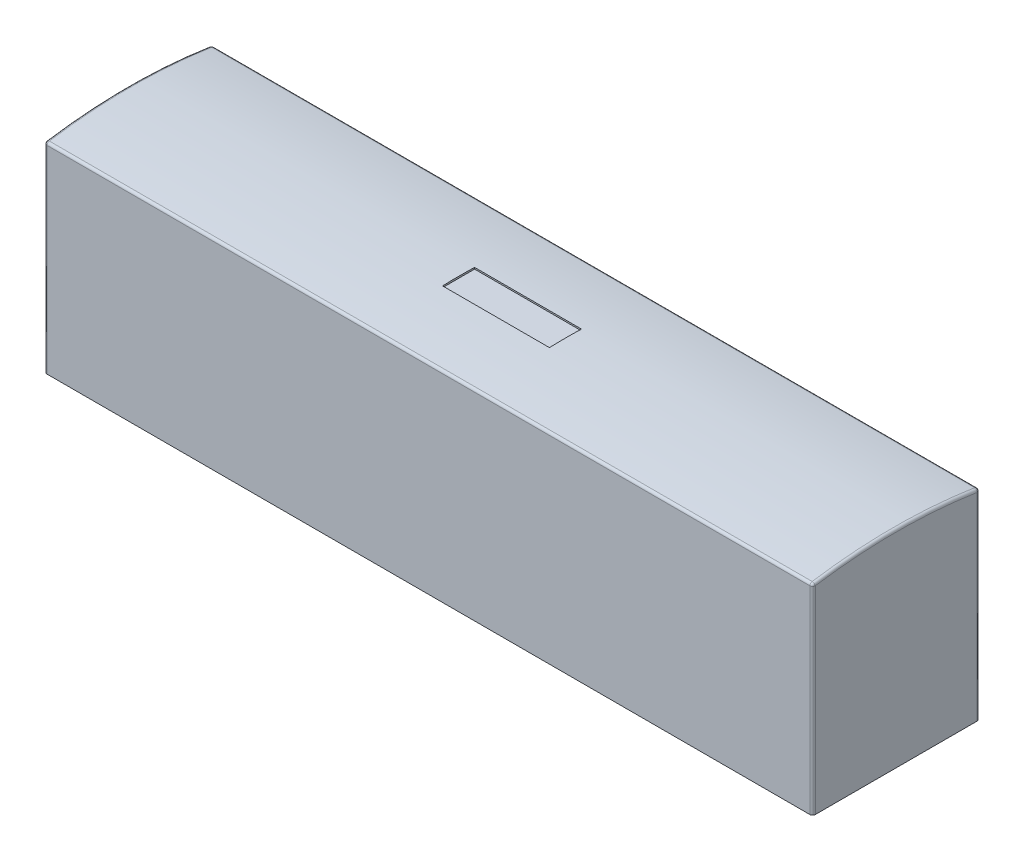
ISO-10303-21;
HEADER;
FILE_DESCRIPTION(('STEP AP214'),'2;1');
FILE_NAME('part.step','',(''),(''),'','','');
FILE_SCHEMA(('AUTOMOTIVE_DESIGN { 1 0 10303 214 1 1 1 1 }'));
ENDSEC;
DATA;
#1=APPLICATION_CONTEXT('core data for automotive mechanical design processes');
#2=APPLICATION_PROTOCOL_DEFINITION('international standard','automotive_design',2000,#1);
#3=PRODUCT_CONTEXT('',#1,'mechanical');
#4=PRODUCT('Part','Part','',(#3));
#5=PRODUCT_RELATED_PRODUCT_CATEGORY('part','',(#4));
#6=PRODUCT_DEFINITION_FORMATION('','',#4);
#7=PRODUCT_DEFINITION_CONTEXT('part definition',#1,'design');
#8=PRODUCT_DEFINITION('design','',#6,#7);
#9=PRODUCT_DEFINITION_SHAPE('','',#8);
#10=(LENGTH_UNIT() NAMED_UNIT(*) SI_UNIT(.MILLI.,.METRE.));
#11=(NAMED_UNIT(*) PLANE_ANGLE_UNIT() SI_UNIT($,.RADIAN.));
#12=(NAMED_UNIT(*) SI_UNIT($,.STERADIAN.) SOLID_ANGLE_UNIT());
#13=UNCERTAINTY_MEASURE_WITH_UNIT(LENGTH_MEASURE(1.E-05),#10,'distance_accuracy_value','');
#14=(GEOMETRIC_REPRESENTATION_CONTEXT(3) GLOBAL_UNCERTAINTY_ASSIGNED_CONTEXT((#13)) GLOBAL_UNIT_ASSIGNED_CONTEXT((#10,
#11,#12)) REPRESENTATION_CONTEXT('',''));
#15=CARTESIAN_POINT('',(0.,0.,0.));
#16=DIRECTION('',(0.,0.,1.));
#17=DIRECTION('',(1.,0.,0.));
#18=AXIS2_PLACEMENT_3D('',#15,#16,#17);
#19=CARTESIAN_POINT('',(-3.97181426867137,-7.78151274949029,-1.984375));
#20=DIRECTION('',(1.,0.,0.));
#21=DIRECTION('',(0.,0.,-1.));
#22=AXIS2_PLACEMENT_3D('',#19,#20,#21);
#23=CYLINDRICAL_SURFACE('',#22,12.7);
#24=CARTESIAN_POINT('',(18.19275,-7.78151274949029,-1.984375));
#25=DIRECTION('',(-1.,0.,0.));
#26=DIRECTION('',(0.,0.,1.));
#27=AXIS2_PLACEMENT_3D('',#24,#25,#26);
#28=CIRCLE('',#27,12.7);
#29=CARTESIAN_POINT('',(18.19275,4.77089988865146,-0.0538473618090457));
#30=VERTEX_POINT('',#29);
#31=CARTESIAN_POINT('',(18.19275,4.77089988865146,-3.91490263819095));
#32=VERTEX_POINT('',#31);
#33=EDGE_CURVE('E230',#30,#32,#28,.T.);
#34=ORIENTED_EDGE('',*,*,#33,.T.);
#35=DIRECTION('',(1.,0.,0.));
#36=VECTOR('',#35,1.);
#37=CARTESIAN_POINT('',(-3.97181426867137,4.77089988865146,-3.91490263819095));
#38=LINE('',#37,#36);
#39=CARTESIAN_POINT('',(0.0635000000000002,4.77089988865146,-3.91490263819095));
#40=VERTEX_POINT('',#39);
#41=EDGE_CURVE('E237',#32,#40,#38,.F.);
#42=ORIENTED_EDGE('',*,*,#41,.T.);
#43=CARTESIAN_POINT('',(0.0635000000000002,-7.78151274949029,-1.984375));
#44=DIRECTION('',(1.,0.,0.));
#45=DIRECTION('',(0.,0.,-1.));
#46=AXIS2_PLACEMENT_3D('',#43,#44,#45);
#47=CIRCLE('',#46,12.7);
#48=CARTESIAN_POINT('',(0.0635000000000002,4.77089988865146,-0.0538473618090455));
#49=VERTEX_POINT('',#48);
#50=EDGE_CURVE('E233',#40,#49,#47,.T.);
#51=ORIENTED_EDGE('',*,*,#50,.T.);
#52=DIRECTION('',(1.,0.,0.));
#53=VECTOR('',#52,1.);
#54=CARTESIAN_POINT('',(-3.97181426867137,4.77089988865146,-0.0538473618090453));
#55=LINE('',#54,#53);
#56=EDGE_CURVE('E227',#49,#30,#55,.T.);
#57=ORIENTED_EDGE('',*,*,#56,.T.);
#58=EDGE_LOOP('',(#34,#42,#51,#57));
#59=FACE_BOUND('',#58,.T.);
#60=DIRECTION('',(1.,0.,0.));
#61=VECTOR('',#60,1.);
#62=CARTESIAN_POINT('',(-3.97181426867137,4.91277096405574,-1.603375));
#63=LINE('',#62,#61);
#64=CARTESIAN_POINT('',(10.398125,4.91277096405574,-1.603375));
#65=VERTEX_POINT('',#64);
#66=CARTESIAN_POINT('',(7.858125,4.91277096405574,-1.603375));
#67=VERTEX_POINT('',#66);
#68=EDGE_CURVE('E213',#65,#67,#63,.F.);
#69=ORIENTED_EDGE('',*,*,#68,.T.);
#70=CARTESIAN_POINT('',(7.858125,-7.78151274949029,-1.984375));
#71=DIRECTION('',(1.,0.,0.));
#72=DIRECTION('',(0.,0.,-1.));
#73=AXIS2_PLACEMENT_3D('',#70,#71,#72);
#74=CIRCLE('',#73,12.7);
#75=CARTESIAN_POINT('',(7.858125,4.91277096405573,-2.365375));
#76=VERTEX_POINT('',#75);
#77=EDGE_CURVE('E204',#67,#76,#74,.F.);
#78=ORIENTED_EDGE('',*,*,#77,.T.);
#79=DIRECTION('',(1.,0.,0.));
#80=VECTOR('',#79,1.);
#81=CARTESIAN_POINT('',(-3.97181426867137,4.91277096405573,-2.365375));
#82=LINE('',#81,#80);
#83=CARTESIAN_POINT('',(10.398125,4.91277096405573,-2.365375));
#84=VERTEX_POINT('',#83);
#85=EDGE_CURVE('E208',#76,#84,#82,.T.);
#86=ORIENTED_EDGE('',*,*,#85,.T.);
#87=CARTESIAN_POINT('',(10.398125,-7.78151274949029,-1.984375));
#88=DIRECTION('',(-1.,0.,0.));
#89=DIRECTION('',(0.,0.,1.));
#90=AXIS2_PLACEMENT_3D('',#87,#88,#89);
#91=CIRCLE('',#90,12.7);
#92=EDGE_CURVE('E151',#84,#65,#91,.F.);
#93=ORIENTED_EDGE('',*,*,#92,.T.);
#94=EDGE_LOOP('',(#69,#78,#86,#93));
#95=FACE_BOUND('',#94,.T.);
#96=ADVANCED_FACE('F41',(#59,#95),#23,.T.);
#97=CARTESIAN_POINT('',(0.,4.7625,0.));
#98=DIRECTION('',(1.,0.,0.));
#99=DIRECTION('',(0.,0.,-1.));
#100=AXIS2_PLACEMENT_3D('',#97,#98,#99);
#101=PLANE('',#100);
#102=DIRECTION('',(0.,0.,1.));
#103=VECTOR('',#102,1.);
#104=CARTESIAN_POINT('',(0.,0.,0.));
#105=LINE('',#104,#103);
#106=CARTESIAN_POINT('',(0.,0.,-3.90525));
#107=VERTEX_POINT('',#106);
#108=CARTESIAN_POINT('',(0.,0.,-0.0635));
#109=VERTEX_POINT('',#108);
#110=EDGE_CURVE('E155',#107,#109,#105,.T.);
#111=ORIENTED_EDGE('',*,*,#110,.T.);
#112=DIRECTION('',(0.,-1.,0.));
#113=VECTOR('',#112,1.);
#114=CARTESIAN_POINT('',(0.,4.7625,-0.0635));
#115=LINE('',#114,#113);
#116=CARTESIAN_POINT('',(0.,4.70813782546075,-0.0635));
#117=VERTEX_POINT('',#116);
#118=EDGE_CURVE('E224',#109,#117,#115,.F.);
#119=ORIENTED_EDGE('',*,*,#118,.T.);
#120=CARTESIAN_POINT('',(0.,-7.78151274949029,-1.984375));
#121=DIRECTION('',(1.,0.,0.));
#122=DIRECTION('',(0.,0.,-1.));
#123=AXIS2_PLACEMENT_3D('',#120,#121,#122);
#124=CIRCLE('',#123,12.6365);
#125=CARTESIAN_POINT('',(0.,4.70813782546075,-3.90525));
#126=VERTEX_POINT('',#125);
#127=EDGE_CURVE('E220',#117,#126,#124,.F.);
#128=ORIENTED_EDGE('',*,*,#127,.T.);
#129=DIRECTION('',(0.,-1.,0.));
#130=VECTOR('',#129,1.);
#131=CARTESIAN_POINT('',(0.,4.7625,-3.90525));
#132=LINE('',#131,#130);
#133=EDGE_CURVE('E217',#126,#107,#132,.T.);
#134=ORIENTED_EDGE('',*,*,#133,.T.);
#135=EDGE_LOOP('',(#111,#119,#128,#134));
#136=FACE_BOUND('',#135,.T.);
#137=ADVANCED_FACE('F375',(#136),#101,.F.);
#138=CARTESIAN_POINT('',(0.,4.7625,0.));
#139=DIRECTION('',(0.,0.,-1.));
#140=DIRECTION('',(-1.,0.,0.));
#141=AXIS2_PLACEMENT_3D('',#138,#139,#140);
#142=PLANE('',#141);
#143=DIRECTION('',(-1.,0.,0.));
#144=VECTOR('',#143,1.);
#145=CARTESIAN_POINT('',(0.,4.70813782546075,0.));
#146=LINE('',#145,#144);
#147=CARTESIAN_POINT('',(18.19275,4.70813782546075,0.));
#148=VERTEX_POINT('',#147);
#149=CARTESIAN_POINT('',(0.0635,4.70813782546075,0.));
#150=VERTEX_POINT('',#149);
#151=EDGE_CURVE('E59',#148,#150,#146,.T.);
#152=ORIENTED_EDGE('',*,*,#151,.T.);
#153=DIRECTION('',(0.,-1.,0.));
#154=VECTOR('',#153,1.);
#155=CARTESIAN_POINT('',(0.0635,4.7625,0.));
#156=LINE('',#155,#154);
#157=CARTESIAN_POINT('',(0.0635,0.,0.));
#158=VERTEX_POINT('',#157);
#159=EDGE_CURVE('E262',#150,#158,#156,.T.);
#160=ORIENTED_EDGE('',*,*,#159,.T.);
#161=DIRECTION('',(1.,0.,0.));
#162=VECTOR('',#161,1.);
#163=CARTESIAN_POINT('',(0.,0.,0.));
#164=LINE('',#163,#162);
#165=CARTESIAN_POINT('',(18.19275,0.,0.));
#166=VERTEX_POINT('',#165);
#167=EDGE_CURVE('E193',#158,#166,#164,.T.);
#168=ORIENTED_EDGE('',*,*,#167,.T.);
#169=DIRECTION('',(0.,-1.,0.));
#170=VECTOR('',#169,1.);
#171=CARTESIAN_POINT('',(18.19275,4.7625,0.));
#172=LINE('',#171,#170);
#173=EDGE_CURVE('E64',#166,#148,#172,.F.);
#174=ORIENTED_EDGE('',*,*,#173,.T.);
#175=EDGE_LOOP('',(#152,#160,#168,#174));
#176=FACE_BOUND('',#175,.T.);
#177=ADVANCED_FACE('F347',(#176),#142,.F.);
#178=CARTESIAN_POINT('',(18.25625,4.7625,0.));
#179=DIRECTION('',(-1.,0.,0.));
#180=DIRECTION('',(0.,0.,1.));
#181=AXIS2_PLACEMENT_3D('',#178,#179,#180);
#182=PLANE('',#181);
#183=DIRECTION('',(0.,0.,-1.));
#184=VECTOR('',#183,1.);
#185=CARTESIAN_POINT('',(18.25625,0.,0.));
#186=LINE('',#185,#184);
#187=CARTESIAN_POINT('',(18.25625,0.,-0.0635));
#188=VERTEX_POINT('',#187);
#189=CARTESIAN_POINT('',(18.25625,0.,-3.90525));
#190=VERTEX_POINT('',#189);
#191=EDGE_CURVE('E196',#188,#190,#186,.T.);
#192=ORIENTED_EDGE('',*,*,#191,.T.);
#193=DIRECTION('',(0.,-1.,0.));
#194=VECTOR('',#193,1.);
#195=CARTESIAN_POINT('',(18.25625,4.7625,-3.90525));
#196=LINE('',#195,#194);
#197=CARTESIAN_POINT('',(18.25625,4.70813782546075,-3.90525));
#198=VERTEX_POINT('',#197);
#199=EDGE_CURVE('E246',#190,#198,#196,.F.);
#200=ORIENTED_EDGE('',*,*,#199,.T.);
#201=CARTESIAN_POINT('',(18.25625,-7.78151274949029,-1.984375));
#202=DIRECTION('',(-1.,0.,0.));
#203=DIRECTION('',(0.,0.,1.));
#204=AXIS2_PLACEMENT_3D('',#201,#202,#203);
#205=CIRCLE('',#204,12.6365);
#206=CARTESIAN_POINT('',(18.25625,4.70813782546075,-0.0635));
#207=VERTEX_POINT('',#206);
#208=EDGE_CURVE('E243',#198,#207,#205,.F.);
#209=ORIENTED_EDGE('',*,*,#208,.T.);
#210=DIRECTION('',(0.,-1.,0.));
#211=VECTOR('',#210,1.);
#212=CARTESIAN_POINT('',(18.25625,4.7625,-0.0635));
#213=LINE('',#212,#211);
#214=EDGE_CURVE('E240',#207,#188,#213,.T.);
#215=ORIENTED_EDGE('',*,*,#214,.T.);
#216=EDGE_LOOP('',(#192,#200,#209,#215));
#217=FACE_BOUND('',#216,.T.);
#218=ADVANCED_FACE('F354',(#217),#182,.F.);
#219=CARTESIAN_POINT('',(0.,4.7625,-3.96875));
#220=DIRECTION('',(0.,0.,1.));
#221=DIRECTION('',(1.,0.,0.));
#222=AXIS2_PLACEMENT_3D('',#219,#220,#221);
#223=PLANE('',#222);
#224=DIRECTION('',(-1.,0.,0.));
#225=VECTOR('',#224,1.);
#226=CARTESIAN_POINT('',(0.,0.,-3.96875));
#227=LINE('',#226,#225);
#228=CARTESIAN_POINT('',(18.19275,0.,-3.96875));
#229=VERTEX_POINT('',#228);
#230=CARTESIAN_POINT('',(0.0635,0.,-3.96875));
#231=VERTEX_POINT('',#230);
#232=EDGE_CURVE('E200',#229,#231,#227,.T.);
#233=ORIENTED_EDGE('',*,*,#232,.T.);
#234=DIRECTION('',(0.,-1.,0.));
#235=VECTOR('',#234,1.);
#236=CARTESIAN_POINT('',(0.0635,4.7625,-3.96875));
#237=LINE('',#236,#235);
#238=CARTESIAN_POINT('',(0.0635,4.70813782546075,-3.96875));
#239=VERTEX_POINT('',#238);
#240=EDGE_CURVE('E255',#231,#239,#237,.F.);
#241=ORIENTED_EDGE('',*,*,#240,.T.);
#242=DIRECTION('',(-1.,0.,0.));
#243=VECTOR('',#242,1.);
#244=CARTESIAN_POINT('',(18.25625,4.70813782546075,-3.96875));
#245=LINE('',#244,#243);
#246=CARTESIAN_POINT('',(18.19275,4.70813782546075,-3.96875));
#247=VERTEX_POINT('',#246);
#248=EDGE_CURVE('E252',#239,#247,#245,.F.);
#249=ORIENTED_EDGE('',*,*,#248,.T.);
#250=DIRECTION('',(0.,-1.,0.));
#251=VECTOR('',#250,1.);
#252=CARTESIAN_POINT('',(18.19275,4.7625,-3.96875));
#253=LINE('',#252,#251);
#254=EDGE_CURVE('E249',#247,#229,#253,.T.);
#255=ORIENTED_EDGE('',*,*,#254,.T.);
#256=EDGE_LOOP('',(#233,#241,#249,#255));
#257=FACE_BOUND('',#256,.T.);
#258=ADVANCED_FACE('F377',(#257),#223,.F.);
#259=CARTESIAN_POINT('',(0.,0.,0.));
#260=DIRECTION('',(0.,-1.,0.));
#261=DIRECTION('',(0.,0.,-1.));
#262=AXIS2_PLACEMENT_3D('',#259,#260,#261);
#263=PLANE('',#262);
#264=ORIENTED_EDGE('',*,*,#167,.F.);
#265=CARTESIAN_POINT('',(0.0635,0.,-0.0635));
#266=DIRECTION('',(0.,-1.,0.));
#267=DIRECTION('',(0.,0.,-1.));
#268=AXIS2_PLACEMENT_3D('',#265,#266,#267);
#269=CIRCLE('',#268,0.0635);
#270=EDGE_CURVE('E11',#158,#109,#269,.T.);
#271=ORIENTED_EDGE('',*,*,#270,.T.);
#272=ORIENTED_EDGE('',*,*,#110,.F.);
#273=CARTESIAN_POINT('',(0.0635,0.,-3.90525));
#274=DIRECTION('',(0.,-1.,0.));
#275=DIRECTION('',(0.,0.,-1.));
#276=AXIS2_PLACEMENT_3D('',#273,#274,#275);
#277=CIRCLE('',#276,0.0635);
#278=EDGE_CURVE('E51',#107,#231,#277,.T.);
#279=ORIENTED_EDGE('',*,*,#278,.T.);
#280=ORIENTED_EDGE('',*,*,#232,.F.);
#281=CARTESIAN_POINT('',(18.19275,0.,-3.90525));
#282=DIRECTION('',(0.,-1.,0.));
#283=DIRECTION('',(0.,0.,-1.));
#284=AXIS2_PLACEMENT_3D('',#281,#282,#283);
#285=CIRCLE('',#284,0.0635);
#286=EDGE_CURVE('E268',#229,#190,#285,.T.);
#287=ORIENTED_EDGE('',*,*,#286,.T.);
#288=ORIENTED_EDGE('',*,*,#191,.F.);
#289=CARTESIAN_POINT('',(18.19275,0.,-0.0635));
#290=DIRECTION('',(0.,-1.,0.));
#291=DIRECTION('',(0.,0.,-1.));
#292=AXIS2_PLACEMENT_3D('',#289,#290,#291);
#293=CIRCLE('',#292,0.0635);
#294=EDGE_CURVE('E265',#188,#166,#293,.T.);
#295=ORIENTED_EDGE('',*,*,#294,.T.);
#296=EDGE_LOOP('',(#264,#271,#272,#279,#280,#287,#288,#295));
#297=FACE_BOUND('',#296,.T.);
#298=ADVANCED_FACE('F349',(#297),#263,.T.);
#299=CARTESIAN_POINT('',(10.398125,4.91848725050971,-1.603375));
#300=DIRECTION('',(-1.,0.,0.));
#301=DIRECTION('',(0.,0.,1.));
#302=AXIS2_PLACEMENT_3D('',#299,#300,#301);
#303=PLANE('',#302);
#304=DIRECTION('',(0.,-1.,0.));
#305=VECTOR('',#304,1.);
#306=CARTESIAN_POINT('',(10.398125,4.91848725050971,-2.365375));
#307=LINE('',#306,#305);
#308=CARTESIAN_POINT('',(10.398125,4.8768,-2.365375));
#309=VERTEX_POINT('',#308);
#310=EDGE_CURVE('E144',#84,#309,#307,.T.);
#311=ORIENTED_EDGE('',*,*,#310,.T.);
#312=DIRECTION('',(0.,0.,-1.));
#313=VECTOR('',#312,1.);
#314=CARTESIAN_POINT('',(10.398125,4.8768,-1.603375));
#315=LINE('',#314,#313);
#316=CARTESIAN_POINT('',(10.398125,4.8768,-1.603375));
#317=VERTEX_POINT('',#316);
#318=EDGE_CURVE('E149',#317,#309,#315,.T.);
#319=ORIENTED_EDGE('',*,*,#318,.F.);
#320=DIRECTION('',(0.,-1.,0.));
#321=VECTOR('',#320,1.);
#322=CARTESIAN_POINT('',(10.398125,4.91848725050971,-1.603375));
#323=LINE('',#322,#321);
#324=EDGE_CURVE('E182',#65,#317,#323,.T.);
#325=ORIENTED_EDGE('',*,*,#324,.F.);
#326=ORIENTED_EDGE('',*,*,#92,.F.);
#327=EDGE_LOOP('',(#311,#319,#325,#326));
#328=FACE_BOUND('',#327,.T.);
#329=ADVANCED_FACE('F146',(#328),#303,.T.);
#330=CARTESIAN_POINT('',(7.858125,4.91848725050971,-2.365375));
#331=DIRECTION('',(0.,0.,1.));
#332=DIRECTION('',(1.,0.,0.));
#333=AXIS2_PLACEMENT_3D('',#330,#331,#332);
#334=PLANE('',#333);
#335=DIRECTION('',(0.,-1.,0.));
#336=VECTOR('',#335,1.);
#337=CARTESIAN_POINT('',(7.858125,4.91848725050971,-2.365375));
#338=LINE('',#337,#336);
#339=CARTESIAN_POINT('',(7.858125,4.8768,-2.365375));
#340=VERTEX_POINT('',#339);
#341=EDGE_CURVE('E156',#76,#340,#338,.T.);
#342=ORIENTED_EDGE('',*,*,#341,.T.);
#343=DIRECTION('',(-1.,0.,0.));
#344=VECTOR('',#343,1.);
#345=CARTESIAN_POINT('',(7.858125,4.8768,-2.365375));
#346=LINE('',#345,#344);
#347=EDGE_CURVE('E159',#309,#340,#346,.T.);
#348=ORIENTED_EDGE('',*,*,#347,.F.);
#349=ORIENTED_EDGE('',*,*,#310,.F.);
#350=ORIENTED_EDGE('',*,*,#85,.F.);
#351=EDGE_LOOP('',(#342,#348,#349,#350));
#352=FACE_BOUND('',#351,.T.);
#353=ADVANCED_FACE('F160',(#352),#334,.T.);
#354=CARTESIAN_POINT('',(7.858125,4.91848725050971,-1.603375));
#355=DIRECTION('',(1.,0.,0.));
#356=DIRECTION('',(0.,0.,-1.));
#357=AXIS2_PLACEMENT_3D('',#354,#355,#356);
#358=PLANE('',#357);
#359=DIRECTION('',(0.,-1.,0.));
#360=VECTOR('',#359,1.);
#361=CARTESIAN_POINT('',(7.858125,4.91848725050971,-1.603375));
#362=LINE('',#361,#360);
#363=CARTESIAN_POINT('',(7.858125,4.8768,-1.603375));
#364=VERTEX_POINT('',#363);
#365=EDGE_CURVE('E185',#67,#364,#362,.T.);
#366=ORIENTED_EDGE('',*,*,#365,.T.);
#367=DIRECTION('',(0.,0.,1.));
#368=VECTOR('',#367,1.);
#369=CARTESIAN_POINT('',(7.858125,4.8768,-1.603375));
#370=LINE('',#369,#368);
#371=EDGE_CURVE('E166',#340,#364,#370,.T.);
#372=ORIENTED_EDGE('',*,*,#371,.F.);
#373=ORIENTED_EDGE('',*,*,#341,.F.);
#374=ORIENTED_EDGE('',*,*,#77,.F.);
#375=EDGE_LOOP('',(#366,#372,#373,#374));
#376=FACE_BOUND('',#375,.T.);
#377=ADVANCED_FACE('F397',(#376),#358,.T.);
#378=CARTESIAN_POINT('',(7.858125,4.91848725050971,-1.603375));
#379=DIRECTION('',(0.,0.,-1.));
#380=DIRECTION('',(-1.,0.,0.));
#381=AXIS2_PLACEMENT_3D('',#378,#379,#380);
#382=PLANE('',#381);
#383=ORIENTED_EDGE('',*,*,#324,.T.);
#384=DIRECTION('',(1.,0.,0.));
#385=VECTOR('',#384,1.);
#386=CARTESIAN_POINT('',(7.858125,4.8768,-1.603375));
#387=LINE('',#386,#385);
#388=EDGE_CURVE('E171',#364,#317,#387,.T.);
#389=ORIENTED_EDGE('',*,*,#388,.F.);
#390=ORIENTED_EDGE('',*,*,#365,.F.);
#391=ORIENTED_EDGE('',*,*,#68,.F.);
#392=EDGE_LOOP('',(#383,#389,#390,#391));
#393=FACE_BOUND('',#392,.T.);
#394=ADVANCED_FACE('F400',(#393),#382,.T.);
#395=CARTESIAN_POINT('',(0.,4.8768,0.));
#396=DIRECTION('',(0.,-1.,0.));
#397=DIRECTION('',(0.,0.,-1.));
#398=AXIS2_PLACEMENT_3D('',#395,#396,#397);
#399=PLANE('',#398);
#400=ORIENTED_EDGE('',*,*,#318,.T.);
#401=ORIENTED_EDGE('',*,*,#347,.T.);
#402=ORIENTED_EDGE('',*,*,#371,.T.);
#403=ORIENTED_EDGE('',*,*,#388,.T.);
#404=EDGE_LOOP('',(#400,#401,#402,#403));
#405=FACE_BOUND('',#404,.T.);
#406=ADVANCED_FACE('F169',(#405),#399,.F.);
#407=CARTESIAN_POINT('',(18.19275,4.7625,-0.0635));
#408=DIRECTION('',(0.,-1.,0.));
#409=DIRECTION('',(0.,0.,-1.));
#410=AXIS2_PLACEMENT_3D('',#407,#408,#409);
#411=CYLINDRICAL_SURFACE('',#410,0.0635);
#412=ORIENTED_EDGE('',*,*,#294,.F.);
#413=ORIENTED_EDGE('',*,*,#214,.F.);
#414=CARTESIAN_POINT('',(18.19275,4.70813782546075,-0.0635));
#415=DIRECTION('',(0.,1.,0.));
#416=DIRECTION('',(-1.,0.,0.));
#417=AXIS2_PLACEMENT_3D('',#414,#415,#416);
#418=CIRCLE('',#417,0.0635);
#419=EDGE_CURVE('E176',#148,#207,#418,.T.);
#420=ORIENTED_EDGE('',*,*,#419,.F.);
#421=ORIENTED_EDGE('',*,*,#173,.F.);
#422=EDGE_LOOP('',(#412,#413,#420,#421));
#423=FACE_BOUND('',#422,.T.);
#424=ADVANCED_FACE('F43',(#423),#411,.T.);
#425=CARTESIAN_POINT('',(18.19275,4.7625,-3.90525));
#426=DIRECTION('',(0.,-1.,0.));
#427=DIRECTION('',(0.,0.,-1.));
#428=AXIS2_PLACEMENT_3D('',#425,#426,#427);
#429=CYLINDRICAL_SURFACE('',#428,0.0635);
#430=ORIENTED_EDGE('',*,*,#286,.F.);
#431=ORIENTED_EDGE('',*,*,#254,.F.);
#432=CARTESIAN_POINT('',(18.19275,4.70813782546075,-3.90525));
#433=DIRECTION('',(0.,1.,0.));
#434=DIRECTION('',(0.,0.,1.));
#435=AXIS2_PLACEMENT_3D('',#432,#433,#434);
#436=CIRCLE('',#435,0.0635);
#437=EDGE_CURVE('E307',#198,#247,#436,.T.);
#438=ORIENTED_EDGE('',*,*,#437,.F.);
#439=ORIENTED_EDGE('',*,*,#199,.F.);
#440=EDGE_LOOP('',(#430,#431,#438,#439));
#441=FACE_BOUND('',#440,.T.);
#442=ADVANCED_FACE('F356',(#441),#429,.T.);
#443=CARTESIAN_POINT('',(18.19275,-7.78151274949029,-1.984375));
#444=DIRECTION('',(-1.,0.,0.));
#445=DIRECTION('',(0.,0.,1.));
#446=AXIS2_PLACEMENT_3D('',#443,#444,#445);
#447=TOROIDAL_SURFACE('',#446,12.6365,0.0635);
#448=CARTESIAN_POINT('',(18.19275,4.70813782546075,-0.0635));
#449=DIRECTION('',(0.,-0.152010050251256,0.988378947885178));
#450=DIRECTION('',(0.,-0.988378947885178,-0.152010050251256));
#451=AXIS2_PLACEMENT_3D('',#448,#449,#450);
#452=CIRCLE('',#451,0.0635);
#453=EDGE_CURVE('E45',#207,#30,#452,.T.);
#454=ORIENTED_EDGE('',*,*,#453,.F.);
#455=ORIENTED_EDGE('',*,*,#208,.F.);
#456=CARTESIAN_POINT('',(18.19275,4.70813782546075,-3.90525));
#457=DIRECTION('',(0.,-0.152010050251255,-0.988378947885178));
#458=DIRECTION('',(0.,0.988378947885178,-0.152010050251255));
#459=AXIS2_PLACEMENT_3D('',#456,#457,#458);
#460=CIRCLE('',#459,0.0635);
#461=EDGE_CURVE('E303',#32,#198,#460,.T.);
#462=ORIENTED_EDGE('',*,*,#461,.F.);
#463=ORIENTED_EDGE('',*,*,#33,.F.);
#464=EDGE_LOOP('',(#454,#455,#462,#463));
#465=FACE_BOUND('',#464,.T.);
#466=ADVANCED_FACE('F324',(#465),#447,.T.);
#467=CARTESIAN_POINT('',(18.19275,4.70813782546075,-0.0635));
#468=DIRECTION('',(1.,0.,0.));
#469=DIRECTION('',(0.,0.,-1.));
#470=AXIS2_PLACEMENT_3D('',#467,#468,#469);
#471=SPHERICAL_SURFACE('',#470,0.0635);
#472=ORIENTED_EDGE('',*,*,#419,.T.);
#473=ORIENTED_EDGE('',*,*,#453,.T.);
#474=CARTESIAN_POINT('',(18.19275,4.70813782546075,-0.0635000000000005));
#475=DIRECTION('',(1.,0.,0.));
#476=DIRECTION('',(0.,0.,-1.));
#477=AXIS2_PLACEMENT_3D('',#474,#475,#476);
#478=CIRCLE('',#477,0.0635);
#479=EDGE_CURVE('E299',#148,#30,#478,.F.);
#480=ORIENTED_EDGE('',*,*,#479,.F.);
#481=EDGE_LOOP('',(#472,#473,#480));
#482=FACE_BOUND('',#481,.T.);
#483=ADVANCED_FACE('F314',(#482),#471,.T.);
#484=CARTESIAN_POINT('',(18.19275,4.70813782546075,-3.90525));
#485=DIRECTION('',(1.,0.,0.));
#486=DIRECTION('',(0.,0.,-1.));
#487=AXIS2_PLACEMENT_3D('',#484,#485,#486);
#488=SPHERICAL_SURFACE('',#487,0.0635);
#489=ORIENTED_EDGE('',*,*,#461,.T.);
#490=ORIENTED_EDGE('',*,*,#437,.T.);
#491=CARTESIAN_POINT('',(18.19275,4.70813782546075,-3.90525));
#492=DIRECTION('',(1.,0.,0.));
#493=DIRECTION('',(0.,1.,0.));
#494=AXIS2_PLACEMENT_3D('',#491,#492,#493);
#495=CIRCLE('',#494,0.0635);
#496=EDGE_CURVE('E295',#32,#247,#495,.F.);
#497=ORIENTED_EDGE('',*,*,#496,.F.);
#498=EDGE_LOOP('',(#489,#490,#497));
#499=FACE_BOUND('',#498,.T.);
#500=ADVANCED_FACE('F359',(#499),#488,.T.);
#501=CARTESIAN_POINT('',(-3.97181426867137,4.70813782546075,-0.0635000000000004));
#502=DIRECTION('',(1.,0.,0.));
#503=DIRECTION('',(0.,0.,-1.));
#504=AXIS2_PLACEMENT_3D('',#501,#502,#503);
#505=CYLINDRICAL_SURFACE('',#504,0.0635);
#506=ORIENTED_EDGE('',*,*,#479,.T.);
#507=ORIENTED_EDGE('',*,*,#56,.F.);
#508=CARTESIAN_POINT('',(0.0635,4.70813782546075,-0.0635));
#509=DIRECTION('',(-1.,0.,0.));
#510=DIRECTION('',(0.,-1.,0.));
#511=AXIS2_PLACEMENT_3D('',#508,#509,#510);
#512=CIRCLE('',#511,0.0635);
#513=EDGE_CURVE('E291',#150,#49,#512,.T.);
#514=ORIENTED_EDGE('',*,*,#513,.F.);
#515=ORIENTED_EDGE('',*,*,#151,.F.);
#516=EDGE_LOOP('',(#506,#507,#514,#515));
#517=FACE_BOUND('',#516,.T.);
#518=ADVANCED_FACE('F336',(#517),#505,.T.);
#519=CARTESIAN_POINT('',(0.0635,4.7625,-0.0635));
#520=DIRECTION('',(0.,-1.,0.));
#521=DIRECTION('',(0.,0.,-1.));
#522=AXIS2_PLACEMENT_3D('',#519,#520,#521);
#523=CYLINDRICAL_SURFACE('',#522,0.0635);
#524=ORIENTED_EDGE('',*,*,#270,.F.);
#525=ORIENTED_EDGE('',*,*,#159,.F.);
#526=CARTESIAN_POINT('',(0.0635,4.70813782546075,-0.0635));
#527=DIRECTION('',(0.,1.,0.));
#528=DIRECTION('',(0.,0.,1.));
#529=AXIS2_PLACEMENT_3D('',#526,#527,#528);
#530=CIRCLE('',#529,0.0635);
#531=EDGE_CURVE('E287',#117,#150,#530,.T.);
#532=ORIENTED_EDGE('',*,*,#531,.F.);
#533=ORIENTED_EDGE('',*,*,#118,.F.);
#534=EDGE_LOOP('',(#524,#525,#532,#533));
#535=FACE_BOUND('',#534,.T.);
#536=ADVANCED_FACE('F345',(#535),#523,.T.);
#537=CARTESIAN_POINT('',(0.0635,4.7625,-3.90525));
#538=DIRECTION('',(0.,-1.,0.));
#539=DIRECTION('',(0.,0.,-1.));
#540=AXIS2_PLACEMENT_3D('',#537,#538,#539);
#541=CYLINDRICAL_SURFACE('',#540,0.0635);
#542=ORIENTED_EDGE('',*,*,#278,.F.);
#543=ORIENTED_EDGE('',*,*,#133,.F.);
#544=CARTESIAN_POINT('',(0.0635,4.70813782546075,-3.90525));
#545=DIRECTION('',(0.,1.,0.));
#546=DIRECTION('',(-1.,0.,0.));
#547=AXIS2_PLACEMENT_3D('',#544,#545,#546);
#548=CIRCLE('',#547,0.0635);
#549=EDGE_CURVE('E283',#239,#126,#548,.T.);
#550=ORIENTED_EDGE('',*,*,#549,.F.);
#551=ORIENTED_EDGE('',*,*,#240,.F.);
#552=EDGE_LOOP('',(#542,#543,#550,#551));
#553=FACE_BOUND('',#552,.T.);
#554=ADVANCED_FACE('F373',(#553),#541,.T.);
#555=CARTESIAN_POINT('',(-3.97181426867137,4.70813782546075,-3.90525));
#556=DIRECTION('',(1.,0.,0.));
#557=DIRECTION('',(0.,0.,-1.));
#558=AXIS2_PLACEMENT_3D('',#555,#556,#557);
#559=CYLINDRICAL_SURFACE('',#558,0.0635);
#560=ORIENTED_EDGE('',*,*,#496,.T.);
#561=ORIENTED_EDGE('',*,*,#248,.F.);
#562=CARTESIAN_POINT('',(0.0635000000000002,4.70813782546075,-3.90525));
#563=DIRECTION('',(-1.,0.,0.));
#564=DIRECTION('',(0.,0.,1.));
#565=AXIS2_PLACEMENT_3D('',#562,#563,#564);
#566=CIRCLE('',#565,0.0635);
#567=EDGE_CURVE('E279',#40,#239,#566,.T.);
#568=ORIENTED_EDGE('',*,*,#567,.F.);
#569=ORIENTED_EDGE('',*,*,#41,.F.);
#570=EDGE_LOOP('',(#560,#561,#568,#569));
#571=FACE_BOUND('',#570,.T.);
#572=ADVANCED_FACE('F362',(#571),#559,.T.);
#573=CARTESIAN_POINT('',(0.0635,4.70813782546075,-0.0635));
#574=DIRECTION('',(-1.,0.,0.));
#575=DIRECTION('',(0.,-1.,0.));
#576=AXIS2_PLACEMENT_3D('',#573,#574,#575);
#577=SPHERICAL_SURFACE('',#576,0.0635);
#578=ORIENTED_EDGE('',*,*,#531,.T.);
#579=ORIENTED_EDGE('',*,*,#513,.T.);
#580=CARTESIAN_POINT('',(0.0635000000000002,4.70813782546075,-0.0635000000000003));
#581=DIRECTION('',(0.,-0.152010050251256,0.988378947885177));
#582=DIRECTION('',(0.,-0.988378947885178,-0.152010050251256));
#583=AXIS2_PLACEMENT_3D('',#580,#581,#582);
#584=CIRCLE('',#583,0.0635);
#585=EDGE_CURVE('E276',#117,#49,#584,.F.);
#586=ORIENTED_EDGE('',*,*,#585,.F.);
#587=EDGE_LOOP('',(#578,#579,#586));
#588=FACE_BOUND('',#587,.T.);
#589=ADVANCED_FACE('F340',(#588),#577,.T.);
#590=CARTESIAN_POINT('',(0.0635,4.70813782546075,-3.90525));
#591=DIRECTION('',(-1.,0.,0.));
#592=DIRECTION('',(0.,0.,1.));
#593=AXIS2_PLACEMENT_3D('',#590,#591,#592);
#594=SPHERICAL_SURFACE('',#593,0.0635);
#595=ORIENTED_EDGE('',*,*,#567,.T.);
#596=ORIENTED_EDGE('',*,*,#549,.T.);
#597=CARTESIAN_POINT('',(0.0635,4.70813782546075,-3.90525));
#598=DIRECTION('',(0.,-0.152010050251259,-0.988378947885177));
#599=DIRECTION('',(0.,0.988378947885177,-0.152010050251259));
#600=AXIS2_PLACEMENT_3D('',#597,#598,#599);
#601=CIRCLE('',#600,0.0635);
#602=EDGE_CURVE('E273',#40,#126,#601,.F.);
#603=ORIENTED_EDGE('',*,*,#602,.F.);
#604=EDGE_LOOP('',(#595,#596,#603));
#605=FACE_BOUND('',#604,.T.);
#606=ADVANCED_FACE('F368',(#605),#594,.T.);
#607=CARTESIAN_POINT('',(0.0635000000000002,-7.78151274949029,-1.984375));
#608=DIRECTION('',(1.,0.,0.));
#609=DIRECTION('',(0.,0.,-1.));
#610=AXIS2_PLACEMENT_3D('',#607,#608,#609);
#611=TOROIDAL_SURFACE('',#610,12.6365,0.0635);
#612=ORIENTED_EDGE('',*,*,#585,.T.);
#613=ORIENTED_EDGE('',*,*,#50,.F.);
#614=ORIENTED_EDGE('',*,*,#602,.T.);
#615=ORIENTED_EDGE('',*,*,#127,.F.);
#616=EDGE_LOOP('',(#612,#613,#614,#615));
#617=FACE_BOUND('',#616,.T.);
#618=ADVANCED_FACE('F367',(#617),#611,.T.);
#619=CLOSED_SHELL('',(#96,#137,#177,#218,#258,#298,#329,#353,#377,#394,#406,#424,#442,#466,#483,
#500,#518,#536,#554,#572,#589,#606,#618));
#620=MANIFOLD_SOLID_BREP('B2',#619);
#621=ADVANCED_BREP_SHAPE_REPRESENTATION('',(#18,#620),#14);
#622=SHAPE_DEFINITION_REPRESENTATION(#9,#621);
ENDSEC;
END-ISO-10303-21;
